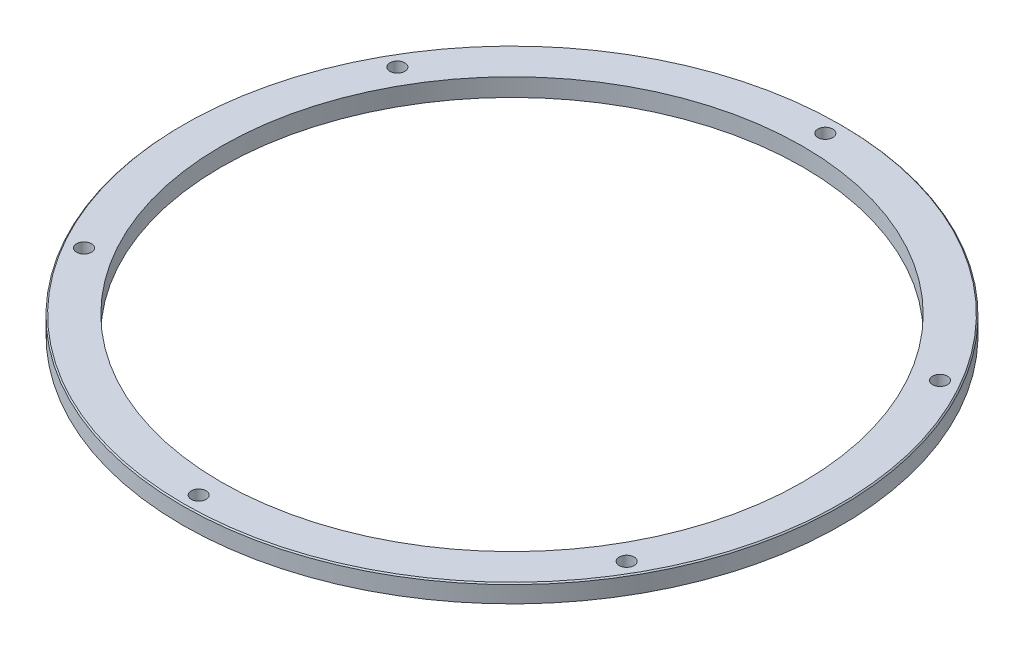
ISO-10303-21;
HEADER;
FILE_DESCRIPTION(('STEP AP214'),'2;1');
FILE_NAME('part.step','',(''),(''),'','','');
FILE_SCHEMA(('AUTOMOTIVE_DESIGN { 1 0 10303 214 1 1 1 1 }'));
ENDSEC;
DATA;
#1=APPLICATION_CONTEXT('core data for automotive mechanical design processes');
#2=APPLICATION_PROTOCOL_DEFINITION('international standard','automotive_design',2000,#1);
#3=PRODUCT_CONTEXT('',#1,'mechanical');
#4=PRODUCT('Part','Part','',(#3));
#5=PRODUCT_RELATED_PRODUCT_CATEGORY('part','',(#4));
#6=PRODUCT_DEFINITION_FORMATION('','',#4);
#7=PRODUCT_DEFINITION_CONTEXT('part definition',#1,'design');
#8=PRODUCT_DEFINITION('design','',#6,#7);
#9=PRODUCT_DEFINITION_SHAPE('','',#8);
#10=(LENGTH_UNIT() NAMED_UNIT(*) SI_UNIT(.MILLI.,.METRE.));
#11=(NAMED_UNIT(*) PLANE_ANGLE_UNIT() SI_UNIT($,.RADIAN.));
#12=(NAMED_UNIT(*) SI_UNIT($,.STERADIAN.) SOLID_ANGLE_UNIT());
#13=UNCERTAINTY_MEASURE_WITH_UNIT(LENGTH_MEASURE(1.E-05),#10,'distance_accuracy_value','');
#14=(GEOMETRIC_REPRESENTATION_CONTEXT(3) GLOBAL_UNCERTAINTY_ASSIGNED_CONTEXT((#13)) GLOBAL_UNIT_ASSIGNED_CONTEXT((#10,
#11,#12)) REPRESENTATION_CONTEXT('',''));
#15=CARTESIAN_POINT('',(0.,0.,0.));
#16=DIRECTION('',(0.,0.,1.));
#17=DIRECTION('',(1.,0.,0.));
#18=AXIS2_PLACEMENT_3D('',#15,#16,#17);
#19=CARTESIAN_POINT('',(0.,3.,0.));
#20=DIRECTION('',(0.,1.,0.));
#21=DIRECTION('',(0.,0.,1.));
#22=AXIS2_PLACEMENT_3D('',#19,#20,#21);
#23=PLANE('',#22);
#24=CARTESIAN_POINT('',(0.,3.,0.));
#25=DIRECTION('',(0.,1.,0.));
#26=DIRECTION('',(0.,0.,1.));
#27=AXIS2_PLACEMENT_3D('',#24,#25,#26);
#28=CIRCLE('',#27,55.05);
#29=CARTESIAN_POINT('',(0.,3.,55.05));
#30=VERTEX_POINT('',#29);
#31=EDGE_CURVE('E40',#30,#30,#28,.T.);
#32=ORIENTED_EDGE('',*,*,#31,.T.);
#33=EDGE_LOOP('',(#32));
#34=FACE_BOUND('',#33,.T.);
#35=CARTESIAN_POINT('',(0.,3.,-52.525));
#36=DIRECTION('',(0.,1.,0.));
#37=DIRECTION('',(0.,0.,1.));
#38=AXIS2_PLACEMENT_3D('',#35,#36,#37);
#39=CIRCLE('',#38,1.24999999999999);
#40=CARTESIAN_POINT('',(0.,3.,-51.275));
#41=VERTEX_POINT('',#40);
#42=EDGE_CURVE('E89',#41,#41,#39,.T.);
#43=ORIENTED_EDGE('',*,*,#42,.F.);
#44=EDGE_LOOP('',(#43));
#45=FACE_BOUND('',#44,.T.);
#46=CARTESIAN_POINT('',(45.4879843337787,3.,-26.2625000000019));
#47=DIRECTION('',(0.,1.,0.));
#48=DIRECTION('',(0.,0.,1.));
#49=AXIS2_PLACEMENT_3D('',#46,#47,#48);
#50=CIRCLE('',#49,1.24999999999999);
#51=CARTESIAN_POINT('',(45.4879843337787,3.,-25.012500000002));
#52=VERTEX_POINT('',#51);
#53=EDGE_CURVE('E83',#52,#52,#50,.T.);
#54=ORIENTED_EDGE('',*,*,#53,.F.);
#55=EDGE_LOOP('',(#54));
#56=FACE_BOUND('',#55,.T.);
#57=CARTESIAN_POINT('',(45.487984333781,3.,26.2624999999981));
#58=DIRECTION('',(0.,1.,0.));
#59=DIRECTION('',(0.,0.,1.));
#60=AXIS2_PLACEMENT_3D('',#57,#58,#59);
#61=CIRCLE('',#60,1.24999999999999);
#62=CARTESIAN_POINT('',(45.487984333781,3.,27.512499999998));
#63=VERTEX_POINT('',#62);
#64=EDGE_CURVE('E77',#63,#63,#61,.T.);
#65=ORIENTED_EDGE('',*,*,#64,.F.);
#66=EDGE_LOOP('',(#65));
#67=FACE_BOUND('',#66,.T.);
#68=CARTESIAN_POINT('',(4.46568594887087E-12,3.,52.525));
#69=DIRECTION('',(0.,1.,0.));
#70=DIRECTION('',(0.,0.,1.));
#71=AXIS2_PLACEMENT_3D('',#68,#69,#70);
#72=CIRCLE('',#71,1.24999999999999);
#73=CARTESIAN_POINT('',(4.46568594887087E-12,3.,53.775));
#74=VERTEX_POINT('',#73);
#75=EDGE_CURVE('E71',#74,#74,#72,.T.);
#76=ORIENTED_EDGE('',*,*,#75,.F.);
#77=EDGE_LOOP('',(#76));
#78=FACE_BOUND('',#77,.T.);
#79=CARTESIAN_POINT('',(-45.4879843337743,3.,26.262500000002));
#80=DIRECTION('',(0.,1.,0.));
#81=DIRECTION('',(0.,0.,1.));
#82=AXIS2_PLACEMENT_3D('',#79,#80,#81);
#83=CIRCLE('',#82,1.24999999999999);
#84=CARTESIAN_POINT('',(-45.4879843337743,3.,27.5125000000019));
#85=VERTEX_POINT('',#84);
#86=EDGE_CURVE('E65',#85,#85,#83,.T.);
#87=ORIENTED_EDGE('',*,*,#86,.F.);
#88=EDGE_LOOP('',(#87));
#89=FACE_BOUND('',#88,.T.);
#90=CARTESIAN_POINT('',(-45.4879843337765,3.,-26.262499999998));
#91=DIRECTION('',(0.,1.,0.));
#92=DIRECTION('',(0.,0.,1.));
#93=AXIS2_PLACEMENT_3D('',#90,#91,#92);
#94=CIRCLE('',#93,1.24999999999999);
#95=CARTESIAN_POINT('',(-45.4879843337765,3.,-25.012499999998));
#96=VERTEX_POINT('',#95);
#97=EDGE_CURVE('E59',#96,#96,#94,.T.);
#98=ORIENTED_EDGE('',*,*,#97,.F.);
#99=EDGE_LOOP('',(#98));
#100=FACE_BOUND('',#99,.T.);
#101=CARTESIAN_POINT('',(0.,3.,0.));
#102=DIRECTION('',(0.,1.,0.));
#103=DIRECTION('',(0.,0.,1.));
#104=AXIS2_PLACEMENT_3D('',#101,#102,#103);
#105=CIRCLE('',#104,48.75);
#106=CARTESIAN_POINT('',(0.,3.,48.75));
#107=VERTEX_POINT('',#106);
#108=EDGE_CURVE('E48',#107,#107,#105,.T.);
#109=ORIENTED_EDGE('',*,*,#108,.F.);
#110=EDGE_LOOP('',(#109));
#111=FACE_BOUND('',#110,.T.);
#112=ADVANCED_FACE('F33',(#34,#45,#56,#67,#78,#89,#100,#111),#23,.T.);
#113=CARTESIAN_POINT('',(0.,0.,0.));
#114=DIRECTION('',(0.,1.,0.));
#115=DIRECTION('',(0.,0.,1.));
#116=AXIS2_PLACEMENT_3D('',#113,#114,#115);
#117=PLANE('',#116);
#118=CARTESIAN_POINT('',(0.,0.,-52.525));
#119=DIRECTION('',(0.,1.,0.));
#120=DIRECTION('',(0.,0.,1.));
#121=AXIS2_PLACEMENT_3D('',#118,#119,#120);
#122=CIRCLE('',#121,1.25);
#123=CARTESIAN_POINT('',(0.,0.,-51.275));
#124=VERTEX_POINT('',#123);
#125=EDGE_CURVE('E86',#124,#124,#122,.T.);
#126=ORIENTED_EDGE('',*,*,#125,.T.);
#127=EDGE_LOOP('',(#126));
#128=FACE_BOUND('',#127,.T.);
#129=CARTESIAN_POINT('',(45.4879843337787,0.,-26.2625000000019));
#130=DIRECTION('',(0.,1.,0.));
#131=DIRECTION('',(0.,0.,1.));
#132=AXIS2_PLACEMENT_3D('',#129,#130,#131);
#133=CIRCLE('',#132,1.25);
#134=CARTESIAN_POINT('',(45.4879843337787,0.,-25.0125000000019));
#135=VERTEX_POINT('',#134);
#136=EDGE_CURVE('E80',#135,#135,#133,.T.);
#137=ORIENTED_EDGE('',*,*,#136,.T.);
#138=EDGE_LOOP('',(#137));
#139=FACE_BOUND('',#138,.T.);
#140=CARTESIAN_POINT('',(45.487984333781,0.,26.2624999999981));
#141=DIRECTION('',(0.,1.,0.));
#142=DIRECTION('',(0.,0.,1.));
#143=AXIS2_PLACEMENT_3D('',#140,#141,#142);
#144=CIRCLE('',#143,1.25);
#145=CARTESIAN_POINT('',(45.487984333781,0.,27.5124999999981));
#146=VERTEX_POINT('',#145);
#147=EDGE_CURVE('E74',#146,#146,#144,.T.);
#148=ORIENTED_EDGE('',*,*,#147,.T.);
#149=EDGE_LOOP('',(#148));
#150=FACE_BOUND('',#149,.T.);
#151=CARTESIAN_POINT('',(4.46568594887087E-12,0.,52.525));
#152=DIRECTION('',(0.,1.,0.));
#153=DIRECTION('',(0.,0.,1.));
#154=AXIS2_PLACEMENT_3D('',#151,#152,#153);
#155=CIRCLE('',#154,1.25);
#156=CARTESIAN_POINT('',(4.46568594887087E-12,0.,53.775));
#157=VERTEX_POINT('',#156);
#158=EDGE_CURVE('E68',#157,#157,#155,.T.);
#159=ORIENTED_EDGE('',*,*,#158,.T.);
#160=EDGE_LOOP('',(#159));
#161=FACE_BOUND('',#160,.T.);
#162=CARTESIAN_POINT('',(-45.4879843337743,0.,26.262500000002));
#163=DIRECTION('',(0.,1.,0.));
#164=DIRECTION('',(0.,0.,1.));
#165=AXIS2_PLACEMENT_3D('',#162,#163,#164);
#166=CIRCLE('',#165,1.25);
#167=CARTESIAN_POINT('',(-45.4879843337743,0.,27.512500000002));
#168=VERTEX_POINT('',#167);
#169=EDGE_CURVE('E62',#168,#168,#166,.T.);
#170=ORIENTED_EDGE('',*,*,#169,.T.);
#171=EDGE_LOOP('',(#170));
#172=FACE_BOUND('',#171,.T.);
#173=CARTESIAN_POINT('',(-45.4879843337765,0.,-26.262499999998));
#174=DIRECTION('',(0.,1.,0.));
#175=DIRECTION('',(0.,0.,1.));
#176=AXIS2_PLACEMENT_3D('',#173,#174,#175);
#177=CIRCLE('',#176,1.25);
#178=CARTESIAN_POINT('',(-45.4879843337765,0.,-25.012499999998));
#179=VERTEX_POINT('',#178);
#180=EDGE_CURVE('E54',#179,#179,#177,.T.);
#181=ORIENTED_EDGE('',*,*,#180,.T.);
#182=EDGE_LOOP('',(#181));
#183=FACE_BOUND('',#182,.T.);
#184=CARTESIAN_POINT('',(0.,0.,0.));
#185=DIRECTION('',(0.,1.,0.));
#186=DIRECTION('',(0.,0.,1.));
#187=AXIS2_PLACEMENT_3D('',#184,#185,#186);
#188=CIRCLE('',#187,55.25);
#189=CARTESIAN_POINT('',(0.,0.,55.25));
#190=VERTEX_POINT('',#189);
#191=EDGE_CURVE('E44',#190,#190,#188,.T.);
#192=ORIENTED_EDGE('',*,*,#191,.F.);
#193=EDGE_LOOP('',(#192));
#194=FACE_BOUND('',#193,.T.);
#195=CARTESIAN_POINT('',(0.,0.,0.));
#196=DIRECTION('',(0.,1.,0.));
#197=DIRECTION('',(0.,0.,1.));
#198=AXIS2_PLACEMENT_3D('',#195,#196,#197);
#199=CIRCLE('',#198,48.75);
#200=CARTESIAN_POINT('',(0.,0.,48.75));
#201=VERTEX_POINT('',#200);
#202=EDGE_CURVE('E51',#201,#201,#199,.T.);
#203=ORIENTED_EDGE('',*,*,#202,.T.);
#204=EDGE_LOOP('',(#203));
#205=FACE_BOUND('',#204,.T.);
#206=ADVANCED_FACE('F97',(#128,#139,#150,#161,#172,#183,#194,#205),#117,.F.);
#207=CARTESIAN_POINT('',(0.,3.,0.));
#208=DIRECTION('',(0.,-1.,0.));
#209=DIRECTION('',(0.,0.,-1.));
#210=AXIS2_PLACEMENT_3D('',#207,#208,#209);
#211=CYLINDRICAL_SURFACE('',#210,55.25);
#212=CARTESIAN_POINT('',(0.,2.8,0.));
#213=DIRECTION('',(0.,1.,0.));
#214=DIRECTION('',(0.,0.,1.));
#215=AXIS2_PLACEMENT_3D('',#212,#213,#214);
#216=CIRCLE('',#215,55.25);
#217=CARTESIAN_POINT('',(0.,2.8,55.25));
#218=VERTEX_POINT('',#217);
#219=EDGE_CURVE('E10',#218,#218,#216,.F.);
#220=ORIENTED_EDGE('',*,*,#219,.T.);
#221=EDGE_LOOP('',(#220));
#222=FACE_BOUND('',#221,.T.);
#223=ORIENTED_EDGE('',*,*,#191,.T.);
#224=EDGE_LOOP('',(#223));
#225=FACE_BOUND('',#224,.T.);
#226=ADVANCED_FACE('F115',(#222,#225),#211,.T.);
#227=CARTESIAN_POINT('',(0.,3.,0.));
#228=DIRECTION('',(0.,-1.,0.));
#229=DIRECTION('',(0.,0.,-1.));
#230=AXIS2_PLACEMENT_3D('',#227,#228,#229);
#231=CYLINDRICAL_SURFACE('',#230,48.75);
#232=ORIENTED_EDGE('',*,*,#108,.T.);
#233=EDGE_LOOP('',(#232));
#234=FACE_BOUND('',#233,.T.);
#235=ORIENTED_EDGE('',*,*,#202,.F.);
#236=EDGE_LOOP('',(#235));
#237=FACE_BOUND('',#236,.T.);
#238=ADVANCED_FACE('F111',(#234,#237),#231,.F.);
#239=CARTESIAN_POINT('',(-45.4879843337765,3.,-26.262499999998));
#240=DIRECTION('',(0.,1.,0.));
#241=DIRECTION('',(0.,0.,1.));
#242=AXIS2_PLACEMENT_3D('',#239,#240,#241);
#243=CYLINDRICAL_SURFACE('',#242,1.24999999999999);
#244=ORIENTED_EDGE('',*,*,#180,.F.);
#245=EDGE_LOOP('',(#244));
#246=FACE_BOUND('',#245,.T.);
#247=ORIENTED_EDGE('',*,*,#97,.T.);
#248=EDGE_LOOP('',(#247));
#249=FACE_BOUND('',#248,.T.);
#250=ADVANCED_FACE('F114',(#246,#249),#243,.F.);
#251=CARTESIAN_POINT('',(-45.4879843337743,3.,26.262500000002));
#252=DIRECTION('',(0.,1.,0.));
#253=DIRECTION('',(0.,0.,1.));
#254=AXIS2_PLACEMENT_3D('',#251,#252,#253);
#255=CYLINDRICAL_SURFACE('',#254,1.24999999999999);
#256=ORIENTED_EDGE('',*,*,#169,.F.);
#257=EDGE_LOOP('',(#256));
#258=FACE_BOUND('',#257,.T.);
#259=ORIENTED_EDGE('',*,*,#86,.T.);
#260=EDGE_LOOP('',(#259));
#261=FACE_BOUND('',#260,.T.);
#262=ADVANCED_FACE('F131',(#258,#261),#255,.F.);
#263=CARTESIAN_POINT('',(4.46568594887087E-12,3.,52.525));
#264=DIRECTION('',(0.,1.,0.));
#265=DIRECTION('',(0.,0.,1.));
#266=AXIS2_PLACEMENT_3D('',#263,#264,#265);
#267=CYLINDRICAL_SURFACE('',#266,1.24999999999999);
#268=ORIENTED_EDGE('',*,*,#158,.F.);
#269=EDGE_LOOP('',(#268));
#270=FACE_BOUND('',#269,.T.);
#271=ORIENTED_EDGE('',*,*,#75,.T.);
#272=EDGE_LOOP('',(#271));
#273=FACE_BOUND('',#272,.T.);
#274=ADVANCED_FACE('F135',(#270,#273),#267,.F.);
#275=CARTESIAN_POINT('',(45.487984333781,3.,26.2624999999981));
#276=DIRECTION('',(0.,1.,0.));
#277=DIRECTION('',(0.,0.,1.));
#278=AXIS2_PLACEMENT_3D('',#275,#276,#277);
#279=CYLINDRICAL_SURFACE('',#278,1.24999999999999);
#280=ORIENTED_EDGE('',*,*,#147,.F.);
#281=EDGE_LOOP('',(#280));
#282=FACE_BOUND('',#281,.T.);
#283=ORIENTED_EDGE('',*,*,#64,.T.);
#284=EDGE_LOOP('',(#283));
#285=FACE_BOUND('',#284,.T.);
#286=ADVANCED_FACE('F139',(#282,#285),#279,.F.);
#287=CARTESIAN_POINT('',(45.4879843337787,3.,-26.2625000000019));
#288=DIRECTION('',(0.,1.,0.));
#289=DIRECTION('',(0.,0.,1.));
#290=AXIS2_PLACEMENT_3D('',#287,#288,#289);
#291=CYLINDRICAL_SURFACE('',#290,1.24999999999999);
#292=ORIENTED_EDGE('',*,*,#136,.F.);
#293=EDGE_LOOP('',(#292));
#294=FACE_BOUND('',#293,.T.);
#295=ORIENTED_EDGE('',*,*,#53,.T.);
#296=EDGE_LOOP('',(#295));
#297=FACE_BOUND('',#296,.T.);
#298=ADVANCED_FACE('F143',(#294,#297),#291,.F.);
#299=CARTESIAN_POINT('',(0.,3.,-52.525));
#300=DIRECTION('',(0.,1.,0.));
#301=DIRECTION('',(0.,0.,1.));
#302=AXIS2_PLACEMENT_3D('',#299,#300,#301);
#303=CYLINDRICAL_SURFACE('',#302,1.24999999999999);
#304=ORIENTED_EDGE('',*,*,#125,.F.);
#305=EDGE_LOOP('',(#304));
#306=FACE_BOUND('',#305,.T.);
#307=ORIENTED_EDGE('',*,*,#42,.T.);
#308=EDGE_LOOP('',(#307));
#309=FACE_BOUND('',#308,.T.);
#310=ADVANCED_FACE('F93',(#306,#309),#303,.F.);
#311=CARTESIAN_POINT('',(0.,3.,0.));
#312=DIRECTION('',(0.,-1.,0.));
#313=DIRECTION('',(0.,0.,-1.));
#314=AXIS2_PLACEMENT_3D('',#311,#312,#313);
#315=CONICAL_SURFACE('',#314,55.05,0.785398163397483);
#316=ORIENTED_EDGE('',*,*,#219,.F.);
#317=EDGE_LOOP('',(#316));
#318=FACE_BOUND('',#317,.T.);
#319=ORIENTED_EDGE('',*,*,#31,.F.);
#320=EDGE_LOOP('',(#319));
#321=FACE_BOUND('',#320,.T.);
#322=ADVANCED_FACE('F35',(#318,#321),#315,.T.);
#323=CLOSED_SHELL('',(#112,#206,#226,#238,#250,#262,#274,#286,#298,#310,#322));
#324=MANIFOLD_SOLID_BREP('B2',#323);
#325=ADVANCED_BREP_SHAPE_REPRESENTATION('',(#18,#324),#14);
#326=SHAPE_DEFINITION_REPRESENTATION(#9,#325);
ENDSEC;
END-ISO-10303-21;
